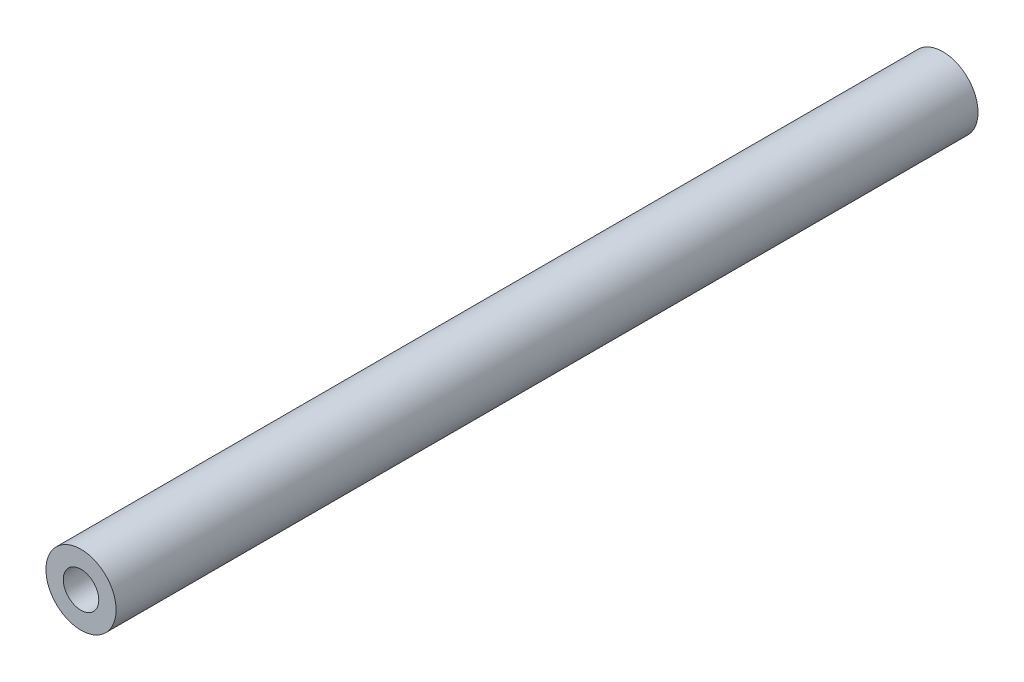
ISO-10303-21;
HEADER;
FILE_DESCRIPTION(('STEP AP214'),'2;1');
FILE_NAME('part.step','',(''),(''),'','','');
FILE_SCHEMA(('AUTOMOTIVE_DESIGN { 1 0 10303 214 1 1 1 1 }'));
ENDSEC;
DATA;
#1=APPLICATION_CONTEXT('core data for automotive mechanical design processes');
#2=APPLICATION_PROTOCOL_DEFINITION('international standard','automotive_design',2000,#1);
#3=PRODUCT_CONTEXT('',#1,'mechanical');
#4=PRODUCT('Part','Part','',(#3));
#5=PRODUCT_RELATED_PRODUCT_CATEGORY('part','',(#4));
#6=PRODUCT_DEFINITION_FORMATION('','',#4);
#7=PRODUCT_DEFINITION_CONTEXT('part definition',#1,'design');
#8=PRODUCT_DEFINITION('design','',#6,#7);
#9=PRODUCT_DEFINITION_SHAPE('','',#8);
#10=(LENGTH_UNIT() NAMED_UNIT(*) SI_UNIT(.MILLI.,.METRE.));
#11=(NAMED_UNIT(*) PLANE_ANGLE_UNIT() SI_UNIT($,.RADIAN.));
#12=(NAMED_UNIT(*) SI_UNIT($,.STERADIAN.) SOLID_ANGLE_UNIT());
#13=UNCERTAINTY_MEASURE_WITH_UNIT(LENGTH_MEASURE(1.E-05),#10,'distance_accuracy_value','');
#14=(GEOMETRIC_REPRESENTATION_CONTEXT(3) GLOBAL_UNCERTAINTY_ASSIGNED_CONTEXT((#13)) GLOBAL_UNIT_ASSIGNED_CONTEXT((#10,
#11,#12)) REPRESENTATION_CONTEXT('',''));
#15=CARTESIAN_POINT('',(0.,0.,0.));
#16=DIRECTION('',(0.,0.,1.));
#17=DIRECTION('',(1.,0.,0.));
#18=AXIS2_PLACEMENT_3D('',#15,#16,#17);
#19=CARTESIAN_POINT('',(0.,0.,622.3));
#20=DIRECTION('',(0.,0.,1.));
#21=DIRECTION('',(1.,0.,0.));
#22=AXIS2_PLACEMENT_3D('',#19,#20,#21);
#23=PLANE('',#22);
#24=CARTESIAN_POINT('',(0.,0.,622.3));
#25=DIRECTION('',(0.,0.,1.));
#26=DIRECTION('',(1.,0.,0.));
#27=AXIS2_PLACEMENT_3D('',#24,#25,#26);
#28=CIRCLE('',#27,25.3272894600442);
#29=CARTESIAN_POINT('',(25.3272894600442,0.,622.3));
#30=VERTEX_POINT('',#29);
#31=EDGE_CURVE('E10',#30,#30,#28,.T.);
#32=ORIENTED_EDGE('',*,*,#31,.T.);
#33=EDGE_LOOP('',(#32));
#34=FACE_BOUND('',#33,.T.);
#35=CARTESIAN_POINT('',(0.,0.,622.3));
#36=DIRECTION('',(0.,0.,1.));
#37=DIRECTION('',(1.,0.,0.));
#38=AXIS2_PLACEMENT_3D('',#35,#36,#37);
#39=CIRCLE('',#38,12.8268137734498);
#40=CARTESIAN_POINT('',(12.8268137734498,0.,622.3));
#41=VERTEX_POINT('',#40);
#42=EDGE_CURVE('E50',#41,#41,#39,.T.);
#43=ORIENTED_EDGE('',*,*,#42,.F.);
#44=EDGE_LOOP('',(#43));
#45=FACE_BOUND('',#44,.T.);
#46=ADVANCED_FACE('F37',(#34,#45),#23,.T.);
#47=CARTESIAN_POINT('',(0.,0.,0.));
#48=DIRECTION('',(0.,0.,1.));
#49=DIRECTION('',(1.,0.,0.));
#50=AXIS2_PLACEMENT_3D('',#47,#48,#49);
#51=PLANE('',#50);
#52=CARTESIAN_POINT('',(0.,0.,0.));
#53=DIRECTION('',(0.,0.,1.));
#54=DIRECTION('',(1.,0.,0.));
#55=AXIS2_PLACEMENT_3D('',#52,#53,#54);
#56=CIRCLE('',#55,25.3272894600442);
#57=CARTESIAN_POINT('',(25.3272894600442,0.,0.));
#58=VERTEX_POINT('',#57);
#59=EDGE_CURVE('E41',#58,#58,#56,.T.);
#60=ORIENTED_EDGE('',*,*,#59,.F.);
#61=EDGE_LOOP('',(#60));
#62=FACE_BOUND('',#61,.T.);
#63=CARTESIAN_POINT('',(0.,0.,0.));
#64=DIRECTION('',(0.,0.,1.));
#65=DIRECTION('',(1.,0.,0.));
#66=AXIS2_PLACEMENT_3D('',#63,#64,#65);
#67=CIRCLE('',#66,12.8268137734498);
#68=CARTESIAN_POINT('',(12.8268137734498,0.,0.));
#69=VERTEX_POINT('',#68);
#70=EDGE_CURVE('E52',#69,#69,#67,.T.);
#71=ORIENTED_EDGE('',*,*,#70,.T.);
#72=EDGE_LOOP('',(#71));
#73=FACE_BOUND('',#72,.T.);
#74=ADVANCED_FACE('F64',(#62,#73),#51,.F.);
#75=CARTESIAN_POINT('',(0.,0.,622.3));
#76=DIRECTION('',(0.,0.,-1.));
#77=DIRECTION('',(-1.,0.,0.));
#78=AXIS2_PLACEMENT_3D('',#75,#76,#77);
#79=CYLINDRICAL_SURFACE('',#78,25.3272894600442);
#80=ORIENTED_EDGE('',*,*,#31,.F.);
#81=EDGE_LOOP('',(#80));
#82=FACE_BOUND('',#81,.T.);
#83=ORIENTED_EDGE('',*,*,#59,.T.);
#84=EDGE_LOOP('',(#83));
#85=FACE_BOUND('',#84,.T.);
#86=ADVANCED_FACE('F39',(#82,#85),#79,.T.);
#87=CARTESIAN_POINT('',(0.,0.,622.3));
#88=DIRECTION('',(0.,0.,-1.));
#89=DIRECTION('',(-1.,0.,0.));
#90=AXIS2_PLACEMENT_3D('',#87,#88,#89);
#91=CYLINDRICAL_SURFACE('',#90,12.8268137734498);
#92=ORIENTED_EDGE('',*,*,#42,.T.);
#93=EDGE_LOOP('',(#92));
#94=FACE_BOUND('',#93,.T.);
#95=ORIENTED_EDGE('',*,*,#70,.F.);
#96=EDGE_LOOP('',(#95));
#97=FACE_BOUND('',#96,.T.);
#98=ADVANCED_FACE('F60',(#94,#97),#91,.F.);
#99=CLOSED_SHELL('',(#46,#74,#86,#98));
#100=MANIFOLD_SOLID_BREP('B2',#99);
#101=ADVANCED_BREP_SHAPE_REPRESENTATION('',(#18,#100),#14);
#102=SHAPE_DEFINITION_REPRESENTATION(#9,#101);
ENDSEC;
END-ISO-10303-21;
